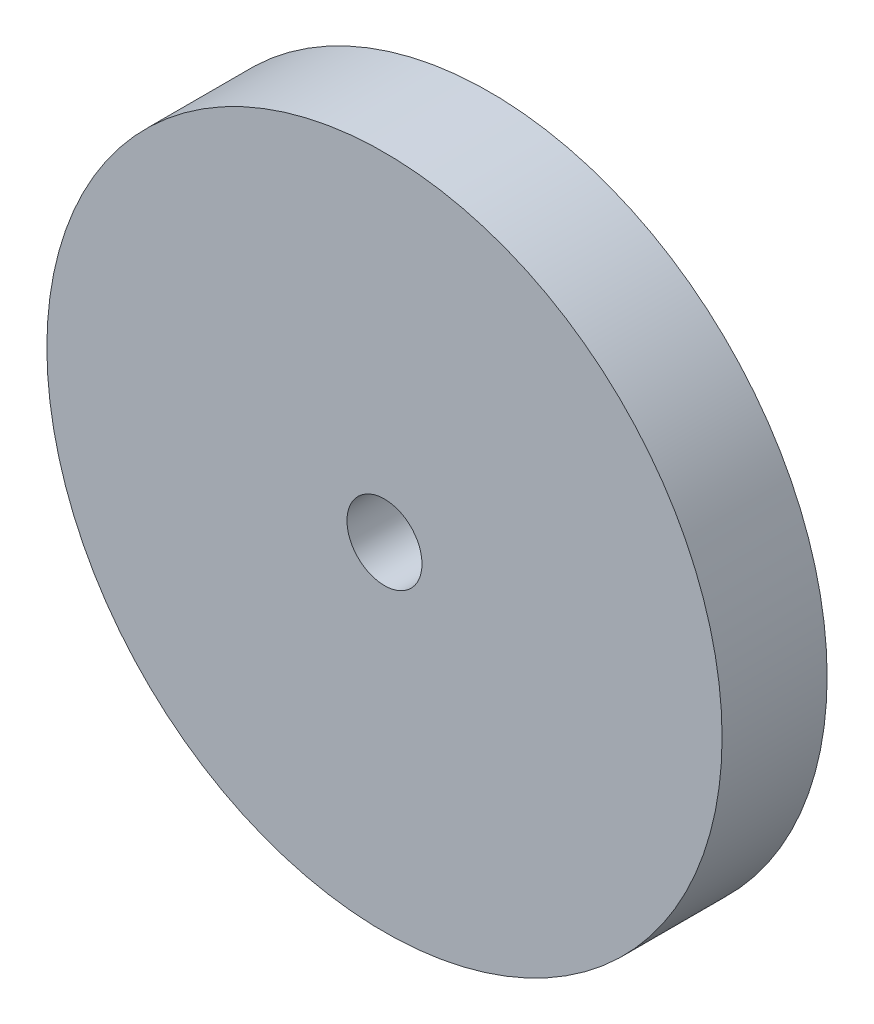
ISO-10303-21;
HEADER;
FILE_DESCRIPTION(('STEP AP214'),'2;1');
FILE_NAME('part.step','',(''),(''),'','','');
FILE_SCHEMA(('AUTOMOTIVE_DESIGN { 1 0 10303 214 1 1 1 1 }'));
ENDSEC;
DATA;
#1=APPLICATION_CONTEXT('core data for automotive mechanical design processes');
#2=APPLICATION_PROTOCOL_DEFINITION('international standard','automotive_design',2000,#1);
#3=PRODUCT_CONTEXT('',#1,'mechanical');
#4=PRODUCT('Part','Part','',(#3));
#5=PRODUCT_RELATED_PRODUCT_CATEGORY('part','',(#4));
#6=PRODUCT_DEFINITION_FORMATION('','',#4);
#7=PRODUCT_DEFINITION_CONTEXT('part definition',#1,'design');
#8=PRODUCT_DEFINITION('design','',#6,#7);
#9=PRODUCT_DEFINITION_SHAPE('','',#8);
#10=(LENGTH_UNIT() NAMED_UNIT(*) SI_UNIT(.MILLI.,.METRE.));
#11=(NAMED_UNIT(*) PLANE_ANGLE_UNIT() SI_UNIT($,.RADIAN.));
#12=(NAMED_UNIT(*) SI_UNIT($,.STERADIAN.) SOLID_ANGLE_UNIT());
#13=UNCERTAINTY_MEASURE_WITH_UNIT(LENGTH_MEASURE(1.E-05),#10,'distance_accuracy_value','');
#14=(GEOMETRIC_REPRESENTATION_CONTEXT(3) GLOBAL_UNCERTAINTY_ASSIGNED_CONTEXT((#13)) GLOBAL_UNIT_ASSIGNED_CONTEXT((#10,
#11,#12)) REPRESENTATION_CONTEXT('',''));
#15=CARTESIAN_POINT('',(0.,0.,0.));
#16=DIRECTION('',(0.,0.,1.));
#17=DIRECTION('',(1.,0.,0.));
#18=AXIS2_PLACEMENT_3D('',#15,#16,#17);
#19=CARTESIAN_POINT('',(0.,0.,2.8));
#20=DIRECTION('',(0.,0.,1.));
#21=DIRECTION('',(1.,0.,0.));
#22=AXIS2_PLACEMENT_3D('',#19,#20,#21);
#23=PLANE('',#22);
#24=CARTESIAN_POINT('',(0.,0.,2.8));
#25=DIRECTION('',(0.,0.,1.));
#26=DIRECTION('',(1.,0.,0.));
#27=AXIS2_PLACEMENT_3D('',#24,#25,#26);
#28=CIRCLE('',#27,9.);
#29=CARTESIAN_POINT('',(9.,0.,2.8));
#30=VERTEX_POINT('',#29);
#31=EDGE_CURVE('E10',#30,#30,#28,.T.);
#32=ORIENTED_EDGE('',*,*,#31,.T.);
#33=EDGE_LOOP('',(#32));
#34=FACE_BOUND('',#33,.T.);
#35=CARTESIAN_POINT('',(0.,0.,2.8));
#36=DIRECTION('',(0.,0.,1.));
#37=DIRECTION('',(1.,0.,0.));
#38=AXIS2_PLACEMENT_3D('',#35,#36,#37);
#39=CIRCLE('',#38,1.);
#40=CARTESIAN_POINT('',(1.,0.,2.8));
#41=VERTEX_POINT('',#40);
#42=EDGE_CURVE('E42',#41,#41,#39,.T.);
#43=ORIENTED_EDGE('',*,*,#42,.F.);
#44=EDGE_LOOP('',(#43));
#45=FACE_BOUND('',#44,.T.);
#46=ADVANCED_FACE('F31',(#34,#45),#23,.T.);
#47=CARTESIAN_POINT('',(0.,0.,0.));
#48=DIRECTION('',(0.,0.,1.));
#49=DIRECTION('',(1.,0.,0.));
#50=AXIS2_PLACEMENT_3D('',#47,#48,#49);
#51=PLANE('',#50);
#52=CARTESIAN_POINT('',(0.,0.,0.));
#53=DIRECTION('',(0.,0.,1.));
#54=DIRECTION('',(1.,0.,0.));
#55=AXIS2_PLACEMENT_3D('',#52,#53,#54);
#56=CIRCLE('',#55,9.);
#57=CARTESIAN_POINT('',(9.,0.,0.));
#58=VERTEX_POINT('',#57);
#59=EDGE_CURVE('E35',#58,#58,#56,.T.);
#60=ORIENTED_EDGE('',*,*,#59,.F.);
#61=EDGE_LOOP('',(#60));
#62=FACE_BOUND('',#61,.T.);
#63=CARTESIAN_POINT('',(0.,0.,0.));
#64=DIRECTION('',(0.,0.,1.));
#65=DIRECTION('',(1.,0.,0.));
#66=AXIS2_PLACEMENT_3D('',#63,#64,#65);
#67=CIRCLE('',#66,1.);
#68=CARTESIAN_POINT('',(1.,0.,0.));
#69=VERTEX_POINT('',#68);
#70=EDGE_CURVE('E44',#69,#69,#67,.T.);
#71=ORIENTED_EDGE('',*,*,#70,.T.);
#72=EDGE_LOOP('',(#71));
#73=FACE_BOUND('',#72,.T.);
#74=ADVANCED_FACE('F54',(#62,#73),#51,.F.);
#75=CARTESIAN_POINT('',(0.,0.,2.8));
#76=DIRECTION('',(0.,0.,-1.));
#77=DIRECTION('',(-1.,0.,0.));
#78=AXIS2_PLACEMENT_3D('',#75,#76,#77);
#79=CYLINDRICAL_SURFACE('',#78,9.);
#80=ORIENTED_EDGE('',*,*,#31,.F.);
#81=EDGE_LOOP('',(#80));
#82=FACE_BOUND('',#81,.T.);
#83=ORIENTED_EDGE('',*,*,#59,.T.);
#84=EDGE_LOOP('',(#83));
#85=FACE_BOUND('',#84,.T.);
#86=ADVANCED_FACE('F33',(#82,#85),#79,.T.);
#87=CARTESIAN_POINT('',(0.,0.,2.8));
#88=DIRECTION('',(0.,0.,-1.));
#89=DIRECTION('',(-1.,0.,0.));
#90=AXIS2_PLACEMENT_3D('',#87,#88,#89);
#91=CYLINDRICAL_SURFACE('',#90,1.);
#92=ORIENTED_EDGE('',*,*,#42,.T.);
#93=EDGE_LOOP('',(#92));
#94=FACE_BOUND('',#93,.T.);
#95=ORIENTED_EDGE('',*,*,#70,.F.);
#96=EDGE_LOOP('',(#95));
#97=FACE_BOUND('',#96,.T.);
#98=ADVANCED_FACE('F50',(#94,#97),#91,.F.);
#99=CLOSED_SHELL('',(#46,#74,#86,#98));
#100=MANIFOLD_SOLID_BREP('B2',#99);
#101=ADVANCED_BREP_SHAPE_REPRESENTATION('',(#18,#100),#14);
#102=SHAPE_DEFINITION_REPRESENTATION(#9,#101);
ENDSEC;
END-ISO-10303-21;
